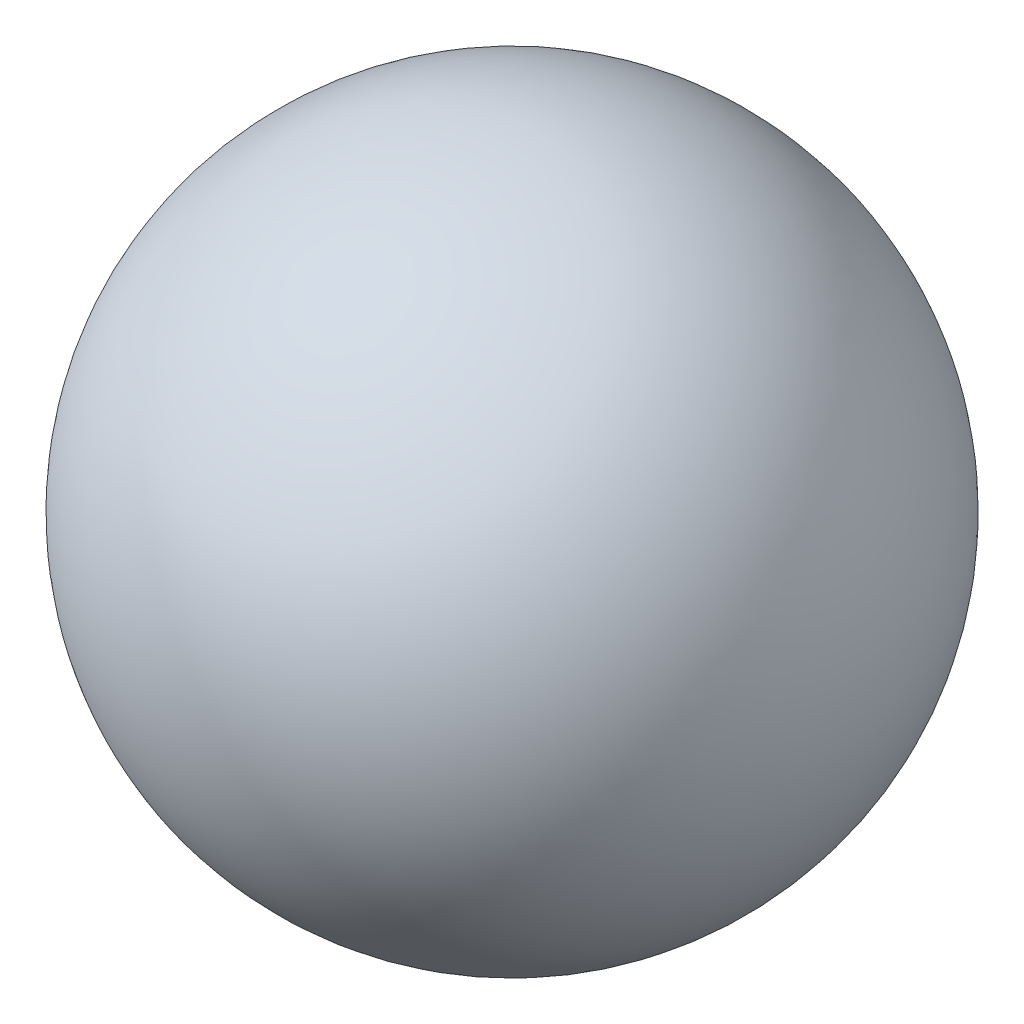
ISO-10303-21;
HEADER;
FILE_DESCRIPTION(('STEP AP214'),'2;1');
FILE_NAME('part.step','',(''),(''),'','','');
FILE_SCHEMA(('AUTOMOTIVE_DESIGN { 1 0 10303 214 1 1 1 1 }'));
ENDSEC;
DATA;
#1=APPLICATION_CONTEXT('core data for automotive mechanical design processes');
#2=APPLICATION_PROTOCOL_DEFINITION('international standard','automotive_design',2000,#1);
#3=PRODUCT_CONTEXT('',#1,'mechanical');
#4=PRODUCT('Part','Part','',(#3));
#5=PRODUCT_RELATED_PRODUCT_CATEGORY('part','',(#4));
#6=PRODUCT_DEFINITION_FORMATION('','',#4);
#7=PRODUCT_DEFINITION_CONTEXT('part definition',#1,'design');
#8=PRODUCT_DEFINITION('design','',#6,#7);
#9=PRODUCT_DEFINITION_SHAPE('','',#8);
#10=(LENGTH_UNIT() NAMED_UNIT(*) SI_UNIT(.MILLI.,.METRE.));
#11=(NAMED_UNIT(*) PLANE_ANGLE_UNIT() SI_UNIT($,.RADIAN.));
#12=(NAMED_UNIT(*) SI_UNIT($,.STERADIAN.) SOLID_ANGLE_UNIT());
#13=UNCERTAINTY_MEASURE_WITH_UNIT(LENGTH_MEASURE(1.E-05),#10,'distance_accuracy_value','');
#14=(GEOMETRIC_REPRESENTATION_CONTEXT(3) GLOBAL_UNCERTAINTY_ASSIGNED_CONTEXT((#13)) GLOBAL_UNIT_ASSIGNED_CONTEXT((#10,
#11,#12)) REPRESENTATION_CONTEXT('',''));
#15=CARTESIAN_POINT('',(0.,0.,0.));
#16=DIRECTION('',(0.,0.,1.));
#17=DIRECTION('',(1.,0.,0.));
#18=AXIS2_PLACEMENT_3D('',#15,#16,#17);
#19=CARTESIAN_POINT('',(0.,0.,0.));
#20=DIRECTION('',(0.,0.,1.));
#21=DIRECTION('',(-1.,0.,0.));
#22=AXIS2_PLACEMENT_3D('',#19,#20,#21);
#23=SPHERICAL_SURFACE('',#22,20.32);
#24=CARTESIAN_POINT('',(0.,0.,20.32));
#25=VERTEX_POINT('',#24);
#26=VERTEX_LOOP('',#25);
#27=FACE_BOUND('',#26,.T.);
#28=ADVANCED_FACE('F31',(#27),#23,.T.);
#29=CLOSED_SHELL('',(#28));
#30=CARTESIAN_POINT('',(0.,0.,0.));
#31=DIRECTION('',(0.,0.,1.));
#32=DIRECTION('',(-1.,0.,0.));
#33=AXIS2_PLACEMENT_3D('',#30,#31,#32);
#34=SPHERICAL_SURFACE('',#33,17.78);
#35=CARTESIAN_POINT('',(0.,0.,17.78));
#36=VERTEX_POINT('',#35);
#37=VERTEX_LOOP('',#36);
#38=FACE_BOUND('',#37,.T.);
#39=ADVANCED_FACE('F33',(#38),#34,.F.);
#40=CLOSED_SHELL('',(#39));
#41=ORIENTED_CLOSED_SHELL('',*,#40,.T.);
#42=BREP_WITH_VOIDS('B2',#29,(#41));
#43=ADVANCED_BREP_SHAPE_REPRESENTATION('',(#18,#42),#14);
#44=SHAPE_DEFINITION_REPRESENTATION(#9,#43);
ENDSEC;
END-ISO-10303-21;
